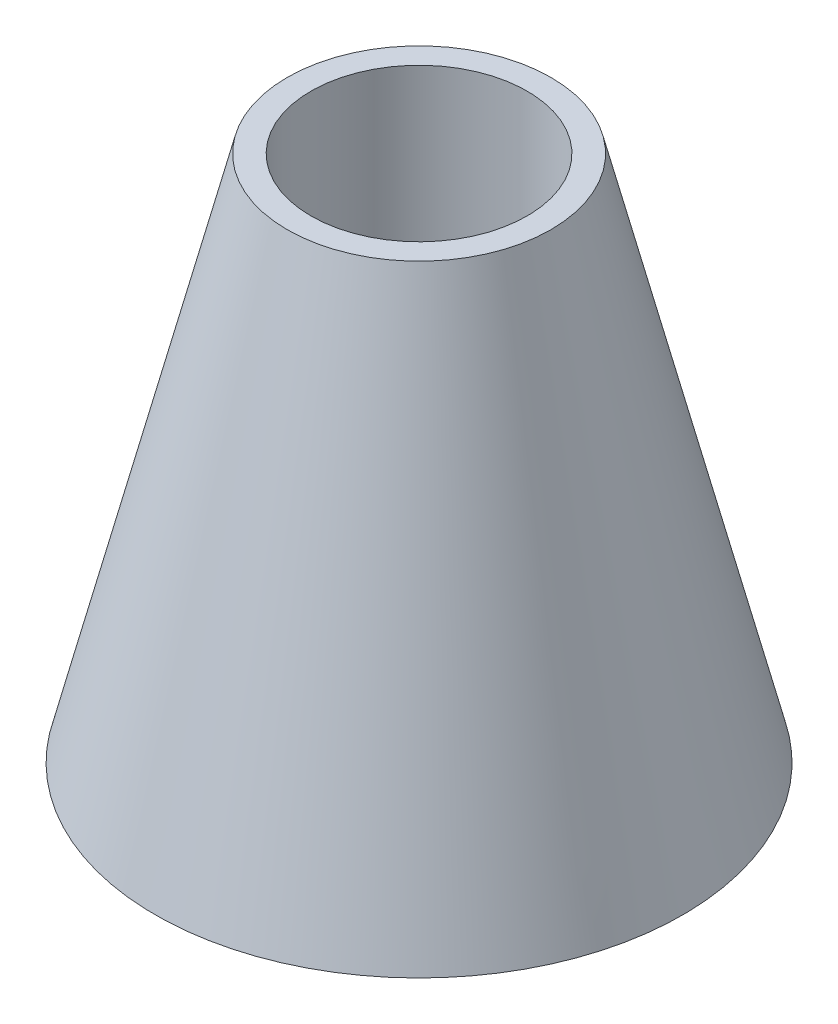
ISO-10303-21;
HEADER;
FILE_DESCRIPTION(('STEP AP214'),'2;1');
FILE_NAME('part.step','',(''),(''),'','','');
FILE_SCHEMA(('AUTOMOTIVE_DESIGN { 1 0 10303 214 1 1 1 1 }'));
ENDSEC;
DATA;
#1=APPLICATION_CONTEXT('core data for automotive mechanical design processes');
#2=APPLICATION_PROTOCOL_DEFINITION('international standard','automotive_design',2000,#1);
#3=PRODUCT_CONTEXT('',#1,'mechanical');
#4=PRODUCT('Part','Part','',(#3));
#5=PRODUCT_RELATED_PRODUCT_CATEGORY('part','',(#4));
#6=PRODUCT_DEFINITION_FORMATION('','',#4);
#7=PRODUCT_DEFINITION_CONTEXT('part definition',#1,'design');
#8=PRODUCT_DEFINITION('design','',#6,#7);
#9=PRODUCT_DEFINITION_SHAPE('','',#8);
#10=(LENGTH_UNIT() NAMED_UNIT(*) SI_UNIT(.MILLI.,.METRE.));
#11=(NAMED_UNIT(*) PLANE_ANGLE_UNIT() SI_UNIT($,.RADIAN.));
#12=(NAMED_UNIT(*) SI_UNIT($,.STERADIAN.) SOLID_ANGLE_UNIT());
#13=UNCERTAINTY_MEASURE_WITH_UNIT(LENGTH_MEASURE(1.E-05),#10,'distance_accuracy_value','');
#14=(GEOMETRIC_REPRESENTATION_CONTEXT(3) GLOBAL_UNCERTAINTY_ASSIGNED_CONTEXT((#13)) GLOBAL_UNIT_ASSIGNED_CONTEXT((#10,
#11,#12)) REPRESENTATION_CONTEXT('',''));
#15=CARTESIAN_POINT('',(0.,0.,0.));
#16=DIRECTION('',(0.,0.,1.));
#17=DIRECTION('',(1.,0.,0.));
#18=AXIS2_PLACEMENT_3D('',#15,#16,#17);
#19=CARTESIAN_POINT('',(0.,0.,0.));
#20=DIRECTION('',(0.,-1.,0.));
#21=DIRECTION('',(0.,0.,-1.));
#22=AXIS2_PLACEMENT_3D('',#19,#20,#21);
#23=PLANE('',#22);
#24=CARTESIAN_POINT('',(0.,0.,0.));
#25=DIRECTION('',(0.,1.,0.));
#26=DIRECTION('',(0.,0.,1.));
#27=AXIS2_PLACEMENT_3D('',#24,#25,#26);
#28=CIRCLE('',#27,41.);
#29=CARTESIAN_POINT('',(0.,0.,41.));
#30=VERTEX_POINT('',#29);
#31=EDGE_CURVE('E76',#30,#30,#28,.T.);
#32=ORIENTED_EDGE('',*,*,#31,.T.);
#33=EDGE_LOOP('',(#32));
#34=FACE_BOUND('',#33,.T.);
#35=CARTESIAN_POINT('',(0.,0.,0.));
#36=DIRECTION('',(0.,-1.,0.));
#37=DIRECTION('',(0.,0.,-1.));
#38=AXIS2_PLACEMENT_3D('',#35,#36,#37);
#39=CIRCLE('',#38,42.);
#40=CARTESIAN_POINT('',(0.,0.,-42.));
#41=VERTEX_POINT('',#40);
#42=EDGE_CURVE('E58',#41,#41,#39,.F.);
#43=ORIENTED_EDGE('',*,*,#42,.F.);
#44=EDGE_LOOP('',(#43));
#45=FACE_BOUND('',#44,.T.);
#46=ADVANCED_FACE('F37',(#34,#45),#23,.T.);
#47=CARTESIAN_POINT('',(0.,200.,0.));
#48=DIRECTION('',(0.,1.,0.));
#49=DIRECTION('',(0.,0.,1.));
#50=AXIS2_PLACEMENT_3D('',#47,#48,#49);
#51=PLANE('',#50);
#52=CARTESIAN_POINT('',(0.,200.,0.));
#53=DIRECTION('',(0.,1.,0.));
#54=DIRECTION('',(0.,0.,1.));
#55=AXIS2_PLACEMENT_3D('',#52,#53,#54);
#56=CIRCLE('',#55,41.);
#57=CARTESIAN_POINT('',(0.,200.,41.));
#58=VERTEX_POINT('',#57);
#59=EDGE_CURVE('E50',#58,#58,#56,.T.);
#60=ORIENTED_EDGE('',*,*,#59,.F.);
#61=EDGE_LOOP('',(#60));
#62=FACE_BOUND('',#61,.T.);
#63=CARTESIAN_POINT('',(0.,200.,0.));
#64=DIRECTION('',(0.,-1.,0.));
#65=DIRECTION('',(0.,0.,-1.));
#66=AXIS2_PLACEMENT_3D('',#63,#64,#65);
#67=CIRCLE('',#66,50.);
#68=CARTESIAN_POINT('',(0.,200.,-50.));
#69=VERTEX_POINT('',#68);
#70=EDGE_CURVE('E10',#69,#69,#67,.T.);
#71=ORIENTED_EDGE('',*,*,#70,.F.);
#72=EDGE_LOOP('',(#71));
#73=FACE_BOUND('',#72,.T.);
#74=ADVANCED_FACE('F39',(#62,#73),#51,.T.);
#75=CARTESIAN_POINT('',(0.,0.,0.));
#76=DIRECTION('',(0.,-1.,0.));
#77=DIRECTION('',(0.,0.,-1.));
#78=AXIS2_PLACEMENT_3D('',#75,#76,#77);
#79=CONICAL_SURFACE('',#78,100.,0.244978663126864);
#80=ORIENTED_EDGE('',*,*,#70,.T.);
#81=EDGE_LOOP('',(#80));
#82=FACE_BOUND('',#81,.T.);
#83=CARTESIAN_POINT('',(0.,0.,0.));
#84=DIRECTION('',(0.,-1.,0.));
#85=DIRECTION('',(0.,0.,-1.));
#86=AXIS2_PLACEMENT_3D('',#83,#84,#85);
#87=CIRCLE('',#86,100.);
#88=CARTESIAN_POINT('',(0.,0.,-100.));
#89=VERTEX_POINT('',#88);
#90=EDGE_CURVE('E45',#89,#89,#87,.T.);
#91=ORIENTED_EDGE('',*,*,#90,.F.);
#92=EDGE_LOOP('',(#91));
#93=FACE_BOUND('',#92,.T.);
#94=ADVANCED_FACE('F97',(#82,#93),#79,.T.);
#95=CARTESIAN_POINT('',(0.,0.,0.));
#96=DIRECTION('',(0.,-1.,0.));
#97=DIRECTION('',(0.,0.,-1.));
#98=AXIS2_PLACEMENT_3D('',#95,#96,#97);
#99=CIRCLE('',#98,99.);
#100=CARTESIAN_POINT('',(0.,0.,-99.));
#101=VERTEX_POINT('',#100);
#102=EDGE_CURVE('E41',#101,#101,#99,.F.);
#103=ORIENTED_EDGE('',*,*,#102,.T.);
#104=EDGE_LOOP('',(#103));
#105=FACE_BOUND('',#104,.T.);
#106=ORIENTED_EDGE('',*,*,#90,.T.);
#107=EDGE_LOOP('',(#106));
#108=FACE_BOUND('',#107,.T.);
#109=ADVANCED_FACE('F86',(#105,#108),#23,.T.);
#110=CARTESIAN_POINT('',(0.,200.,0.));
#111=DIRECTION('',(0.,-1.,0.));
#112=DIRECTION('',(0.,0.,-1.));
#113=AXIS2_PLACEMENT_3D('',#110,#111,#112);
#114=CYLINDRICAL_SURFACE('',#113,41.);
#115=ORIENTED_EDGE('',*,*,#59,.T.);
#116=EDGE_LOOP('',(#115));
#117=FACE_BOUND('',#116,.T.);
#118=ORIENTED_EDGE('',*,*,#31,.F.);
#119=EDGE_LOOP('',(#118));
#120=FACE_BOUND('',#119,.T.);
#121=ADVANCED_FACE('F83',(#117,#120),#114,.F.);
#122=CARTESIAN_POINT('',(0.,2.1,0.));
#123=DIRECTION('',(0.,-1.,0.));
#124=DIRECTION('',(0.,0.,-1.));
#125=AXIS2_PLACEMENT_3D('',#122,#123,#124);
#126=PLANE('',#125);
#127=CARTESIAN_POINT('',(0.,2.1,0.));
#128=DIRECTION('',(0.,-1.,0.));
#129=DIRECTION('',(0.,0.,-1.));
#130=AXIS2_PLACEMENT_3D('',#127,#128,#129);
#131=CIRCLE('',#130,99.);
#132=CARTESIAN_POINT('',(0.,2.1,-99.));
#133=VERTEX_POINT('',#132);
#134=EDGE_CURVE('E57',#133,#133,#131,.T.);
#135=ORIENTED_EDGE('',*,*,#134,.T.);
#136=EDGE_LOOP('',(#135));
#137=FACE_BOUND('',#136,.T.);
#138=CARTESIAN_POINT('',(0.,2.1,0.));
#139=DIRECTION('',(0.,-1.,0.));
#140=DIRECTION('',(0.,0.,-1.));
#141=AXIS2_PLACEMENT_3D('',#138,#139,#140);
#142=CIRCLE('',#141,96.898058983989);
#143=CARTESIAN_POINT('',(0.,2.1,-96.898058983989));
#144=VERTEX_POINT('',#143);
#145=EDGE_CURVE('E54',#144,#144,#142,.F.);
#146=ORIENTED_EDGE('',*,*,#145,.T.);
#147=EDGE_LOOP('',(#146));
#148=FACE_BOUND('',#147,.T.);
#149=ADVANCED_FACE('F85',(#137,#148),#126,.T.);
#150=CARTESIAN_POINT('',(0.,-1.2E-05,0.));
#151=DIRECTION('',(0.,1.,0.));
#152=DIRECTION('',(0.,0.,1.));
#153=AXIS2_PLACEMENT_3D('',#150,#151,#152);
#154=CYLINDRICAL_SURFACE('',#153,99.);
#155=ORIENTED_EDGE('',*,*,#102,.F.);
#156=EDGE_LOOP('',(#155));
#157=FACE_BOUND('',#156,.T.);
#158=ORIENTED_EDGE('',*,*,#134,.F.);
#159=EDGE_LOOP('',(#158));
#160=FACE_BOUND('',#159,.T.);
#161=ADVANCED_FACE('F93',(#157,#160),#154,.F.);
#162=CARTESIAN_POINT('',(0.,2.1,0.));
#163=DIRECTION('',(0.,-1.,0.));
#164=DIRECTION('',(0.,0.,-1.));
#165=AXIS2_PLACEMENT_3D('',#162,#163,#164);
#166=CIRCLE('',#165,42.);
#167=CARTESIAN_POINT('',(0.,2.1,-42.));
#168=VERTEX_POINT('',#167);
#169=EDGE_CURVE('E231',#168,#168,#166,.T.);
#170=ORIENTED_EDGE('',*,*,#169,.F.);
#171=EDGE_LOOP('',(#170));
#172=FACE_BOUND('',#171,.T.);
#173=CARTESIAN_POINT('',(0.,2.1,0.));
#174=DIRECTION('',(0.,-1.,0.));
#175=DIRECTION('',(0.,0.,-1.));
#176=AXIS2_PLACEMENT_3D('',#173,#174,#175);
#177=CIRCLE('',#176,42.5);
#178=CARTESIAN_POINT('',(0.,2.1,-42.5));
#179=VERTEX_POINT('',#178);
#180=EDGE_CURVE('E56',#179,#179,#177,.T.);
#181=ORIENTED_EDGE('',*,*,#180,.T.);
#182=EDGE_LOOP('',(#181));
#183=FACE_BOUND('',#182,.T.);
#184=ADVANCED_FACE('F96',(#172,#183),#126,.T.);
#185=CARTESIAN_POINT('',(0.,-1.2E-05,0.));
#186=DIRECTION('',(0.,1.,0.));
#187=DIRECTION('',(0.,0.,1.));
#188=AXIS2_PLACEMENT_3D('',#185,#186,#187);
#189=CYLINDRICAL_SURFACE('',#188,42.);
#190=ORIENTED_EDGE('',*,*,#42,.T.);
#191=EDGE_LOOP('',(#190));
#192=FACE_BOUND('',#191,.T.);
#193=ORIENTED_EDGE('',*,*,#169,.T.);
#194=EDGE_LOOP('',(#193));
#195=FACE_BOUND('',#194,.T.);
#196=ADVANCED_FACE('F150',(#192,#195),#189,.T.);
#197=CARTESIAN_POINT('',(0.,0.,0.));
#198=DIRECTION('',(0.,-1.,0.));
#199=DIRECTION('',(0.,0.,-1.));
#200=AXIS2_PLACEMENT_3D('',#197,#198,#199);
#201=CYLINDRICAL_SURFACE('',#200,42.5);
#202=CARTESIAN_POINT('',(0.,197.5,0.));
#203=DIRECTION('',(0.,-1.,0.));
#204=DIRECTION('',(0.,0.,-1.));
#205=AXIS2_PLACEMENT_3D('',#202,#203,#204);
#206=CIRCLE('',#205,42.5);
#207=CARTESIAN_POINT('',(0.,197.5,-42.5));
#208=VERTEX_POINT('',#207);
#209=EDGE_CURVE('E73',#208,#208,#206,.T.);
#210=ORIENTED_EDGE('',*,*,#209,.T.);
#211=EDGE_LOOP('',(#210));
#212=FACE_BOUND('',#211,.T.);
#213=ORIENTED_EDGE('',*,*,#180,.F.);
#214=EDGE_LOOP('',(#213));
#215=FACE_BOUND('',#214,.T.);
#216=ADVANCED_FACE('F160',(#212,#215),#201,.T.);
#217=CARTESIAN_POINT('',(0.,2.,0.));
#218=DIRECTION('',(0.,-1.,0.));
#219=DIRECTION('',(0.,0.,-1.));
#220=AXIS2_PLACEMENT_3D('',#217,#218,#219);
#221=CONICAL_SURFACE('',#220,96.923058983989,0.244978663126864);
#222=CARTESIAN_POINT('',(0.,197.5,0.));
#223=DIRECTION('',(0.,-1.,0.));
#224=DIRECTION('',(0.,0.,-1.));
#225=AXIS2_PLACEMENT_3D('',#222,#223,#224);
#226=CIRCLE('',#225,48.048058983989);
#227=CARTESIAN_POINT('',(0.,197.5,-48.048058983989));
#228=VERTEX_POINT('',#227);
#229=EDGE_CURVE('E63',#228,#228,#226,.T.);
#230=ORIENTED_EDGE('',*,*,#229,.F.);
#231=EDGE_LOOP('',(#230));
#232=FACE_BOUND('',#231,.T.);
#233=ORIENTED_EDGE('',*,*,#145,.F.);
#234=EDGE_LOOP('',(#233));
#235=FACE_BOUND('',#234,.T.);
#236=ADVANCED_FACE('F170',(#232,#235),#221,.F.);
#237=CARTESIAN_POINT('',(-3.35517802620463E-13,197.5,-48.048058983989));
#238=DIRECTION('',(0.,1.,0.));
#239=DIRECTION('',(0.,0.,1.));
#240=AXIS2_PLACEMENT_3D('',#237,#238,#239);
#241=PLANE('',#240);
#242=ORIENTED_EDGE('',*,*,#209,.F.);
#243=EDGE_LOOP('',(#242));
#244=FACE_BOUND('',#243,.T.);
#245=ORIENTED_EDGE('',*,*,#229,.T.);
#246=EDGE_LOOP('',(#245));
#247=FACE_BOUND('',#246,.T.);
#248=ADVANCED_FACE('F178',(#244,#247),#241,.F.);
#249=CLOSED_SHELL('',(#46,#74,#94,#109,#121,#149,#161,#184,#196,#216,#236,#248));
#250=MANIFOLD_SOLID_BREP('B2',#249);
#251=ADVANCED_BREP_SHAPE_REPRESENTATION('',(#18,#250),#14);
#252=SHAPE_DEFINITION_REPRESENTATION(#9,#251);
ENDSEC;
END-ISO-10303-21;
